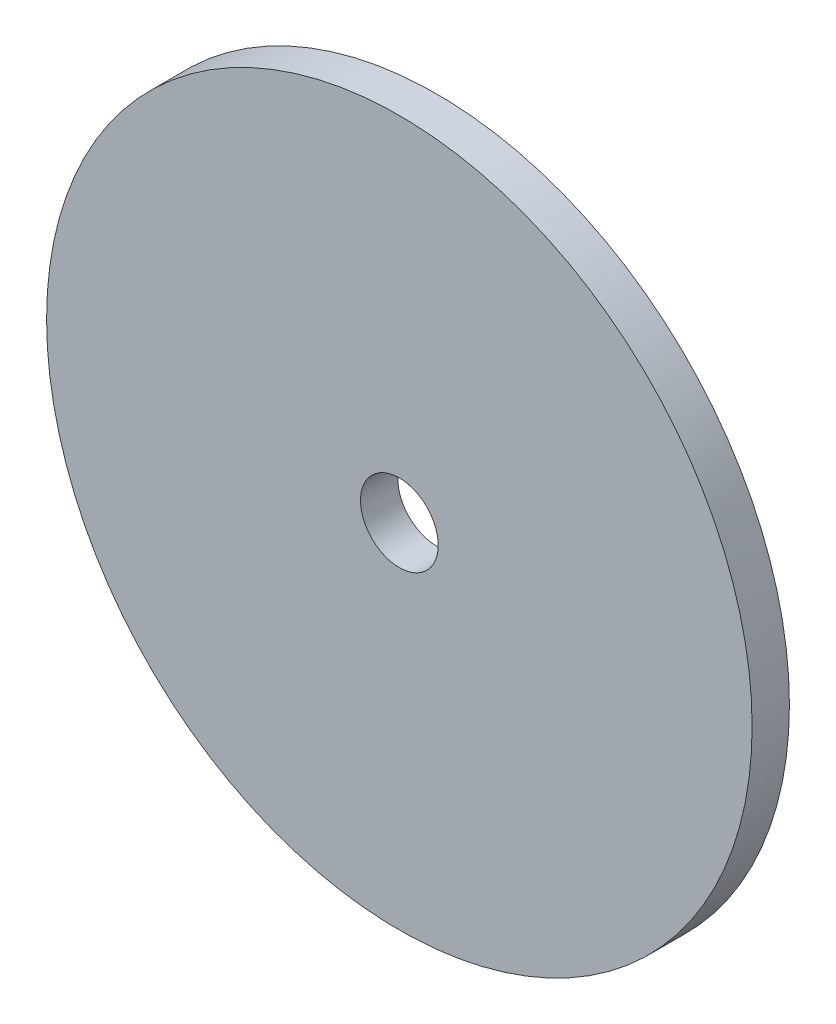
ISO-10303-21;
HEADER;
FILE_DESCRIPTION(('STEP AP214'),'2;1');
FILE_NAME('part.step','',(''),(''),'','','');
FILE_SCHEMA(('AUTOMOTIVE_DESIGN { 1 0 10303 214 1 1 1 1 }'));
ENDSEC;
DATA;
#1=APPLICATION_CONTEXT('core data for automotive mechanical design processes');
#2=APPLICATION_PROTOCOL_DEFINITION('international standard','automotive_design',2000,#1);
#3=PRODUCT_CONTEXT('',#1,'mechanical');
#4=PRODUCT('Part','Part','',(#3));
#5=PRODUCT_RELATED_PRODUCT_CATEGORY('part','',(#4));
#6=PRODUCT_DEFINITION_FORMATION('','',#4);
#7=PRODUCT_DEFINITION_CONTEXT('part definition',#1,'design');
#8=PRODUCT_DEFINITION('design','',#6,#7);
#9=PRODUCT_DEFINITION_SHAPE('','',#8);
#10=(LENGTH_UNIT() NAMED_UNIT(*) SI_UNIT(.MILLI.,.METRE.));
#11=(NAMED_UNIT(*) PLANE_ANGLE_UNIT() SI_UNIT($,.RADIAN.));
#12=(NAMED_UNIT(*) SI_UNIT($,.STERADIAN.) SOLID_ANGLE_UNIT());
#13=UNCERTAINTY_MEASURE_WITH_UNIT(LENGTH_MEASURE(1.E-05),#10,'distance_accuracy_value','');
#14=(GEOMETRIC_REPRESENTATION_CONTEXT(3) GLOBAL_UNCERTAINTY_ASSIGNED_CONTEXT((#13)) GLOBAL_UNIT_ASSIGNED_CONTEXT((#10,
#11,#12)) REPRESENTATION_CONTEXT('',''));
#15=CARTESIAN_POINT('',(0.,0.,0.));
#16=DIRECTION('',(0.,0.,1.));
#17=DIRECTION('',(1.,0.,0.));
#18=AXIS2_PLACEMENT_3D('',#15,#16,#17);
#19=CARTESIAN_POINT('',(0.,0.,3.048));
#20=DIRECTION('',(0.,0.,-1.));
#21=DIRECTION('',(-1.,0.,0.));
#22=AXIS2_PLACEMENT_3D('',#19,#20,#21);
#23=CYLINDRICAL_SURFACE('',#22,28.829);
#24=CARTESIAN_POINT('',(0.,0.,3.048));
#25=DIRECTION('',(0.,0.,1.));
#26=DIRECTION('',(1.,0.,0.));
#27=AXIS2_PLACEMENT_3D('',#24,#25,#26);
#28=CIRCLE('',#27,28.829);
#29=CARTESIAN_POINT('',(28.829,0.,3.048));
#30=VERTEX_POINT('',#29);
#31=EDGE_CURVE('E10',#30,#30,#28,.T.);
#32=ORIENTED_EDGE('',*,*,#31,.F.);
#33=EDGE_LOOP('',(#32));
#34=FACE_BOUND('',#33,.T.);
#35=CARTESIAN_POINT('',(0.,0.,0.));
#36=DIRECTION('',(0.,0.,1.));
#37=DIRECTION('',(1.,0.,0.));
#38=AXIS2_PLACEMENT_3D('',#35,#36,#37);
#39=CIRCLE('',#38,28.829);
#40=CARTESIAN_POINT('',(28.829,0.,0.));
#41=VERTEX_POINT('',#40);
#42=EDGE_CURVE('E39',#41,#41,#39,.T.);
#43=ORIENTED_EDGE('',*,*,#42,.T.);
#44=EDGE_LOOP('',(#43));
#45=FACE_BOUND('',#44,.T.);
#46=ADVANCED_FACE('F36',(#34,#45),#23,.T.);
#47=CARTESIAN_POINT('',(0.,0.,3.048));
#48=DIRECTION('',(0.,0.,1.));
#49=DIRECTION('',(1.,0.,0.));
#50=AXIS2_PLACEMENT_3D('',#47,#48,#49);
#51=PLANE('',#50);
#52=CARTESIAN_POINT('',(0.,0.,3.048));
#53=DIRECTION('',(0.,0.,1.));
#54=DIRECTION('',(1.,0.,0.));
#55=AXIS2_PLACEMENT_3D('',#52,#53,#54);
#56=CIRCLE('',#55,3.175);
#57=CARTESIAN_POINT('',(3.175,0.,3.048));
#58=VERTEX_POINT('',#57);
#59=EDGE_CURVE('E48',#58,#58,#56,.T.);
#60=ORIENTED_EDGE('',*,*,#59,.F.);
#61=EDGE_LOOP('',(#60));
#62=FACE_BOUND('',#61,.T.);
#63=ORIENTED_EDGE('',*,*,#31,.T.);
#64=EDGE_LOOP('',(#63));
#65=FACE_BOUND('',#64,.T.);
#66=ADVANCED_FACE('F63',(#62,#65),#51,.T.);
#67=CARTESIAN_POINT('',(0.,0.,0.));
#68=DIRECTION('',(0.,0.,1.));
#69=DIRECTION('',(1.,0.,0.));
#70=AXIS2_PLACEMENT_3D('',#67,#68,#69);
#71=PLANE('',#70);
#72=CARTESIAN_POINT('',(0.,0.,0.));
#73=DIRECTION('',(0.,0.,1.));
#74=DIRECTION('',(1.,0.,0.));
#75=AXIS2_PLACEMENT_3D('',#72,#73,#74);
#76=CIRCLE('',#75,3.175);
#77=CARTESIAN_POINT('',(3.175,0.,0.));
#78=VERTEX_POINT('',#77);
#79=EDGE_CURVE('E46',#78,#78,#76,.T.);
#80=ORIENTED_EDGE('',*,*,#79,.T.);
#81=EDGE_LOOP('',(#80));
#82=FACE_BOUND('',#81,.T.);
#83=ORIENTED_EDGE('',*,*,#42,.F.);
#84=EDGE_LOOP('',(#83));
#85=FACE_BOUND('',#84,.T.);
#86=ADVANCED_FACE('F54',(#82,#85),#71,.F.);
#87=CARTESIAN_POINT('',(0.,0.,0.));
#88=DIRECTION('',(0.,0.,1.));
#89=DIRECTION('',(1.,0.,0.));
#90=AXIS2_PLACEMENT_3D('',#87,#88,#89);
#91=CYLINDRICAL_SURFACE('',#90,3.175);
#92=ORIENTED_EDGE('',*,*,#79,.F.);
#93=EDGE_LOOP('',(#92));
#94=FACE_BOUND('',#93,.T.);
#95=ORIENTED_EDGE('',*,*,#59,.T.);
#96=EDGE_LOOP('',(#95));
#97=FACE_BOUND('',#96,.T.);
#98=ADVANCED_FACE('F57',(#94,#97),#91,.F.);
#99=CLOSED_SHELL('',(#46,#66,#86,#98));
#100=MANIFOLD_SOLID_BREP('B2',#99);
#101=ADVANCED_BREP_SHAPE_REPRESENTATION('',(#18,#100),#14);
#102=SHAPE_DEFINITION_REPRESENTATION(#9,#101);
ENDSEC;
END-ISO-10303-21;
